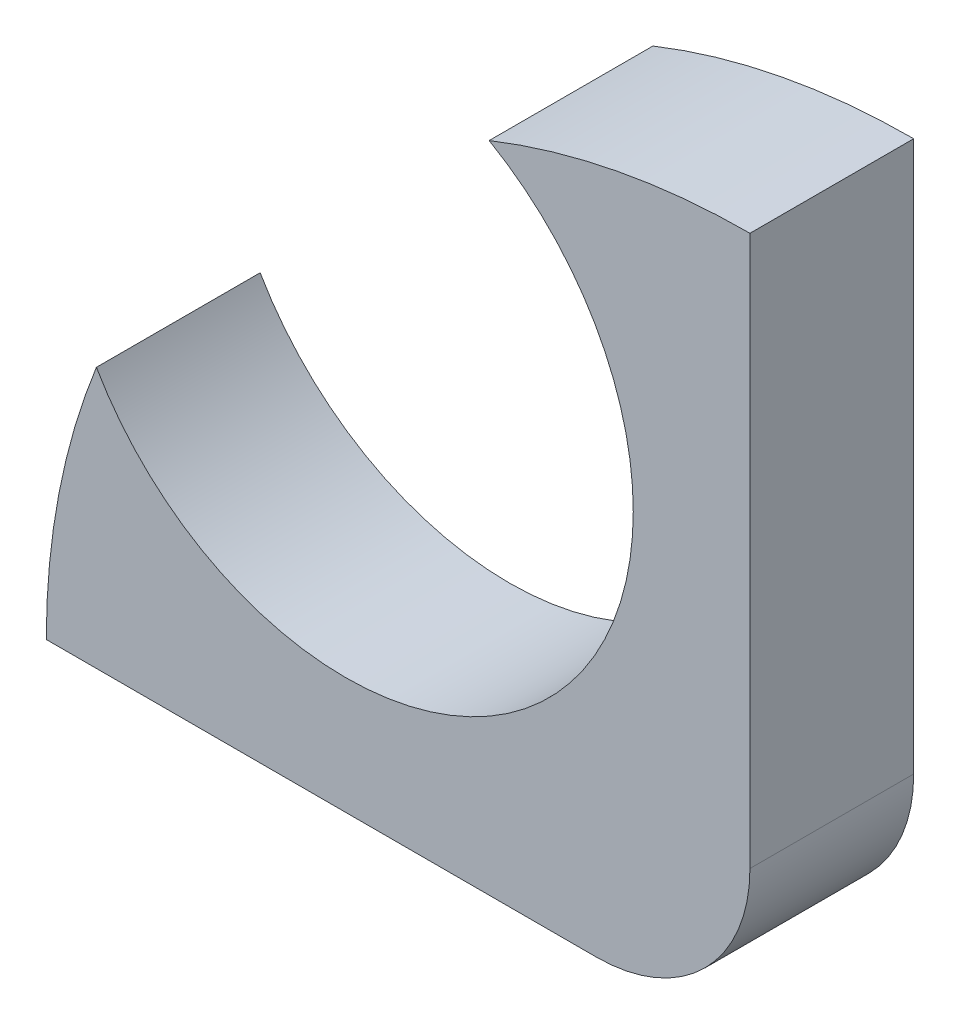
ISO-10303-21;
HEADER;
FILE_DESCRIPTION(('STEP AP214'),'2;1');
FILE_NAME('part.step','',(''),(''),'','','');
FILE_SCHEMA(('AUTOMOTIVE_DESIGN { 1 0 10303 214 1 1 1 1 }'));
ENDSEC;
DATA;
#1=APPLICATION_CONTEXT('core data for automotive mechanical design processes');
#2=APPLICATION_PROTOCOL_DEFINITION('international standard','automotive_design',2000,#1);
#3=PRODUCT_CONTEXT('',#1,'mechanical');
#4=PRODUCT('Part','Part','',(#3));
#5=PRODUCT_RELATED_PRODUCT_CATEGORY('part','',(#4));
#6=PRODUCT_DEFINITION_FORMATION('','',#4);
#7=PRODUCT_DEFINITION_CONTEXT('part definition',#1,'design');
#8=PRODUCT_DEFINITION('design','',#6,#7);
#9=PRODUCT_DEFINITION_SHAPE('','',#8);
#10=(LENGTH_UNIT() NAMED_UNIT(*) SI_UNIT(.MILLI.,.METRE.));
#11=(NAMED_UNIT(*) PLANE_ANGLE_UNIT() SI_UNIT($,.RADIAN.));
#12=(NAMED_UNIT(*) SI_UNIT($,.STERADIAN.) SOLID_ANGLE_UNIT());
#13=UNCERTAINTY_MEASURE_WITH_UNIT(LENGTH_MEASURE(1.E-05),#10,'distance_accuracy_value','');
#14=(GEOMETRIC_REPRESENTATION_CONTEXT(3) GLOBAL_UNCERTAINTY_ASSIGNED_CONTEXT((#13)) GLOBAL_UNIT_ASSIGNED_CONTEXT((#10,
#11,#12)) REPRESENTATION_CONTEXT('',''));
#15=CARTESIAN_POINT('',(0.,0.,0.));
#16=DIRECTION('',(0.,0.,1.));
#17=DIRECTION('',(1.,0.,0.));
#18=AXIS2_PLACEMENT_3D('',#15,#16,#17);
#19=CARTESIAN_POINT('',(18.45,-18.45,1.));
#20=DIRECTION('',(0.,0.,-1.));
#21=DIRECTION('',(0.,-1.,0.));
#22=AXIS2_PLACEMENT_3D('',#19,#20,#21);
#23=PLANE('',#22);
#24=CARTESIAN_POINT('',(18.45,-18.45,1.));
#25=DIRECTION('',(0.,0.,-1.));
#26=DIRECTION('',(-1.,0.,0.));
#27=AXIS2_PLACEMENT_3D('',#24,#25,#26);
#28=CIRCLE('',#27,1.5);
#29=CARTESIAN_POINT('',(19.95,-18.45,1.));
#30=VERTEX_POINT('',#29);
#31=CARTESIAN_POINT('',(18.45,-19.95,1.));
#32=VERTEX_POINT('',#31);
#33=EDGE_CURVE('E382',#30,#32,#28,.T.);
#34=ORIENTED_EDGE('',*,*,#33,.F.);
#35=DIRECTION('',(0.,-1.,0.));
#36=VECTOR('',#35,1.);
#37=CARTESIAN_POINT('',(19.95,-13.075,1.));
#38=LINE('',#37,#36);
#39=CARTESIAN_POINT('',(19.95,-13.075,1.));
#40=VERTEX_POINT('',#39);
#41=EDGE_CURVE('E27',#40,#30,#38,.T.);
#42=ORIENTED_EDGE('',*,*,#41,.F.);
#43=CARTESIAN_POINT('',(19.95,-19.95,1.));
#44=DIRECTION('',(0.,0.,-1.));
#45=DIRECTION('',(-1.,0.,0.));
#46=AXIS2_PLACEMENT_3D('',#43,#44,#45);
#47=CIRCLE('',#46,6.875);
#48=CARTESIAN_POINT('',(17.4018583423997,-13.5646574803851,1.));
#49=VERTEX_POINT('',#48);
#50=EDGE_CURVE('E131',#49,#40,#47,.T.);
#51=ORIENTED_EDGE('',*,*,#50,.F.);
#52=CARTESIAN_POINT('',(16.,-16.,1.));
#53=DIRECTION('',(0.,0.,1.));
#54=DIRECTION('',(-1.,0.,0.));
#55=AXIS2_PLACEMENT_3D('',#52,#53,#54);
#56=CIRCLE('',#55,2.81);
#57=CARTESIAN_POINT('',(18.81,-16.,1.));
#58=VERTEX_POINT('',#57);
#59=EDGE_CURVE('E142',#58,#49,#56,.T.);
#60=ORIENTED_EDGE('',*,*,#59,.F.);
#61=CARTESIAN_POINT('',(16.,-16.,1.));
#62=DIRECTION('',(0.,0.,1.));
#63=DIRECTION('',(-1.,0.,0.));
#64=AXIS2_PLACEMENT_3D('',#61,#62,#63);
#65=CIRCLE('',#64,2.81);
#66=CARTESIAN_POINT('',(13.5646574803851,-17.4018583423997,1.));
#67=VERTEX_POINT('',#66);
#68=EDGE_CURVE('E94',#67,#58,#65,.T.);
#69=ORIENTED_EDGE('',*,*,#68,.F.);
#70=CARTESIAN_POINT('',(19.95,-19.95,1.));
#71=DIRECTION('',(0.,0.,-1.));
#72=DIRECTION('',(-1.,0.,0.));
#73=AXIS2_PLACEMENT_3D('',#70,#71,#72);
#74=CIRCLE('',#73,6.875);
#75=CARTESIAN_POINT('',(13.075,-19.95,1.));
#76=VERTEX_POINT('',#75);
#77=EDGE_CURVE('E109',#76,#67,#74,.T.);
#78=ORIENTED_EDGE('',*,*,#77,.F.);
#79=DIRECTION('',(-1.,0.,0.));
#80=VECTOR('',#79,1.);
#81=CARTESIAN_POINT('',(18.45,-19.95,1.));
#82=LINE('',#81,#80);
#83=EDGE_CURVE('E151',#32,#76,#82,.T.);
#84=ORIENTED_EDGE('',*,*,#83,.F.);
#85=EDGE_LOOP('',(#34,#42,#51,#60,#69,#78,#84));
#86=FACE_BOUND('',#85,.T.);
#87=ADVANCED_FACE('F16',(#86),#23,.F.);
#88=CARTESIAN_POINT('',(18.45,-18.45,-0.6));
#89=DIRECTION('',(0.,0.,-1.));
#90=DIRECTION('',(0.,-1.,0.));
#91=AXIS2_PLACEMENT_3D('',#88,#89,#90);
#92=PLANE('',#91);
#93=CARTESIAN_POINT('',(18.45,-18.45,-0.6));
#94=DIRECTION('',(0.,0.,-1.));
#95=DIRECTION('',(-1.,0.,0.));
#96=AXIS2_PLACEMENT_3D('',#93,#94,#95);
#97=CIRCLE('',#96,1.5);
#98=CARTESIAN_POINT('',(19.95,-18.45,-0.6));
#99=VERTEX_POINT('',#98);
#100=CARTESIAN_POINT('',(18.45,-19.95,-0.6));
#101=VERTEX_POINT('',#100);
#102=EDGE_CURVE('E118',#99,#101,#97,.T.);
#103=ORIENTED_EDGE('',*,*,#102,.T.);
#104=DIRECTION('',(-1.,0.,0.));
#105=VECTOR('',#104,1.);
#106=CARTESIAN_POINT('',(18.45,-19.95,-0.6));
#107=LINE('',#106,#105);
#108=CARTESIAN_POINT('',(13.075,-19.95,-0.6));
#109=VERTEX_POINT('',#108);
#110=EDGE_CURVE('E102',#101,#109,#107,.T.);
#111=ORIENTED_EDGE('',*,*,#110,.T.);
#112=CARTESIAN_POINT('',(19.95,-19.95,-0.6));
#113=DIRECTION('',(0.,0.,-1.));
#114=DIRECTION('',(-1.,0.,0.));
#115=AXIS2_PLACEMENT_3D('',#112,#113,#114);
#116=CIRCLE('',#115,6.875);
#117=CARTESIAN_POINT('',(13.5646574803851,-17.4018583423997,-0.6));
#118=VERTEX_POINT('',#117);
#119=EDGE_CURVE('E95',#109,#118,#116,.T.);
#120=ORIENTED_EDGE('',*,*,#119,.T.);
#121=CARTESIAN_POINT('',(16.,-16.,-0.6));
#122=DIRECTION('',(0.,0.,1.));
#123=DIRECTION('',(-1.,0.,0.));
#124=AXIS2_PLACEMENT_3D('',#121,#122,#123);
#125=CIRCLE('',#124,2.81);
#126=CARTESIAN_POINT('',(18.81,-16.,-0.6));
#127=VERTEX_POINT('',#126);
#128=EDGE_CURVE('E82',#118,#127,#125,.T.);
#129=ORIENTED_EDGE('',*,*,#128,.T.);
#130=CARTESIAN_POINT('',(16.,-16.,-0.6));
#131=DIRECTION('',(0.,0.,1.));
#132=DIRECTION('',(-1.,0.,0.));
#133=AXIS2_PLACEMENT_3D('',#130,#131,#132);
#134=CIRCLE('',#133,2.81);
#135=CARTESIAN_POINT('',(17.4018583423997,-13.5646574803851,-0.6));
#136=VERTEX_POINT('',#135);
#137=EDGE_CURVE('E152',#127,#136,#134,.T.);
#138=ORIENTED_EDGE('',*,*,#137,.T.);
#139=CARTESIAN_POINT('',(19.95,-19.95,-0.6));
#140=DIRECTION('',(0.,0.,-1.));
#141=DIRECTION('',(-1.,0.,0.));
#142=AXIS2_PLACEMENT_3D('',#139,#140,#141);
#143=CIRCLE('',#142,6.875);
#144=CARTESIAN_POINT('',(19.95,-13.075,-0.6));
#145=VERTEX_POINT('',#144);
#146=EDGE_CURVE('E120',#136,#145,#143,.T.);
#147=ORIENTED_EDGE('',*,*,#146,.T.);
#148=DIRECTION('',(0.,-1.,0.));
#149=VECTOR('',#148,1.);
#150=CARTESIAN_POINT('',(19.95,-13.075,-0.6));
#151=LINE('',#150,#149);
#152=EDGE_CURVE('E11',#145,#99,#151,.T.);
#153=ORIENTED_EDGE('',*,*,#152,.T.);
#154=EDGE_LOOP('',(#103,#111,#120,#129,#138,#147,#153));
#155=FACE_BOUND('',#154,.T.);
#156=ADVANCED_FACE('F100',(#155),#92,.T.);
#157=CARTESIAN_POINT('',(19.95,-13.075,-0.6));
#158=DIRECTION('',(-1.,0.,0.));
#159=DIRECTION('',(0.,0.,1.));
#160=AXIS2_PLACEMENT_3D('',#157,#158,#159);
#161=PLANE('',#160);
#162=ORIENTED_EDGE('',*,*,#41,.T.);
#163=DIRECTION('',(0.,0.,1.));
#164=VECTOR('',#163,1.);
#165=CARTESIAN_POINT('',(19.95,-18.45,-0.6));
#166=LINE('',#165,#164);
#167=EDGE_CURVE('E147',#99,#30,#166,.T.);
#168=ORIENTED_EDGE('',*,*,#167,.F.);
#169=ORIENTED_EDGE('',*,*,#152,.F.);
#170=DIRECTION('',(0.,0.,1.));
#171=VECTOR('',#170,1.);
#172=CARTESIAN_POINT('',(19.95,-13.075,-0.6));
#173=LINE('',#172,#171);
#174=EDGE_CURVE('E122',#145,#40,#173,.T.);
#175=ORIENTED_EDGE('',*,*,#174,.T.);
#176=EDGE_LOOP('',(#162,#168,#169,#175));
#177=FACE_BOUND('',#176,.T.);
#178=ADVANCED_FACE('F208',(#177),#161,.F.);
#179=CARTESIAN_POINT('',(19.95,-19.95,-0.6));
#180=DIRECTION('',(0.,0.,1.));
#181=DIRECTION('',(1.,0.,0.));
#182=AXIS2_PLACEMENT_3D('',#179,#180,#181);
#183=CYLINDRICAL_SURFACE('',#182,6.875);
#184=ORIENTED_EDGE('',*,*,#50,.T.);
#185=ORIENTED_EDGE('',*,*,#174,.F.);
#186=ORIENTED_EDGE('',*,*,#146,.F.);
#187=DIRECTION('',(0.,0.,1.));
#188=VECTOR('',#187,1.);
#189=CARTESIAN_POINT('',(17.4018583423997,-13.5646574803851,-0.6));
#190=LINE('',#189,#188);
#191=EDGE_CURVE('E146',#136,#49,#190,.T.);
#192=ORIENTED_EDGE('',*,*,#191,.T.);
#193=EDGE_LOOP('',(#184,#185,#186,#192));
#194=FACE_BOUND('',#193,.T.);
#195=ADVANCED_FACE('F213',(#194),#183,.T.);
#196=CARTESIAN_POINT('',(16.,-16.,-0.6));
#197=DIRECTION('',(0.,0.,1.));
#198=DIRECTION('',(1.,0.,0.));
#199=AXIS2_PLACEMENT_3D('',#196,#197,#198);
#200=CYLINDRICAL_SURFACE('',#199,2.81);
#201=DIRECTION('',(0.,0.,1.));
#202=VECTOR('',#201,1.);
#203=CARTESIAN_POINT('',(18.81,-16.,-0.6));
#204=LINE('',#203,#202);
#205=EDGE_CURVE('E20',#127,#58,#204,.T.);
#206=ORIENTED_EDGE('',*,*,#205,.F.);
#207=ORIENTED_EDGE('',*,*,#128,.F.);
#208=DIRECTION('',(0.,0.,1.));
#209=VECTOR('',#208,1.);
#210=CARTESIAN_POINT('',(13.5646574803851,-17.4018583423997,-0.6));
#211=LINE('',#210,#209);
#212=EDGE_CURVE('E87',#118,#67,#211,.T.);
#213=ORIENTED_EDGE('',*,*,#212,.T.);
#214=ORIENTED_EDGE('',*,*,#68,.T.);
#215=EDGE_LOOP('',(#206,#207,#213,#214));
#216=FACE_BOUND('',#215,.T.);
#217=ADVANCED_FACE('F84',(#216),#200,.F.);
#218=CARTESIAN_POINT('',(19.95,-19.95,-0.6));
#219=DIRECTION('',(0.,0.,1.));
#220=DIRECTION('',(1.,0.,0.));
#221=AXIS2_PLACEMENT_3D('',#218,#219,#220);
#222=CYLINDRICAL_SURFACE('',#221,6.875);
#223=ORIENTED_EDGE('',*,*,#77,.T.);
#224=ORIENTED_EDGE('',*,*,#212,.F.);
#225=ORIENTED_EDGE('',*,*,#119,.F.);
#226=DIRECTION('',(0.,0.,1.));
#227=VECTOR('',#226,1.);
#228=CARTESIAN_POINT('',(13.075,-19.95,-0.6));
#229=LINE('',#228,#227);
#230=EDGE_CURVE('E139',#109,#76,#229,.T.);
#231=ORIENTED_EDGE('',*,*,#230,.T.);
#232=EDGE_LOOP('',(#223,#224,#225,#231));
#233=FACE_BOUND('',#232,.T.);
#234=ADVANCED_FACE('F108',(#233),#222,.T.);
#235=CARTESIAN_POINT('',(18.45,-19.95,-0.6));
#236=DIRECTION('',(0.,1.,0.));
#237=DIRECTION('',(1.,0.,0.));
#238=AXIS2_PLACEMENT_3D('',#235,#236,#237);
#239=PLANE('',#238);
#240=ORIENTED_EDGE('',*,*,#83,.T.);
#241=ORIENTED_EDGE('',*,*,#230,.F.);
#242=ORIENTED_EDGE('',*,*,#110,.F.);
#243=DIRECTION('',(0.,0.,1.));
#244=VECTOR('',#243,1.);
#245=CARTESIAN_POINT('',(18.45,-19.95,-0.6));
#246=LINE('',#245,#244);
#247=EDGE_CURVE('E194',#101,#32,#246,.T.);
#248=ORIENTED_EDGE('',*,*,#247,.T.);
#249=EDGE_LOOP('',(#240,#241,#242,#248));
#250=FACE_BOUND('',#249,.T.);
#251=ADVANCED_FACE('F18',(#250),#239,.F.);
#252=CARTESIAN_POINT('',(18.45,-18.45,-0.6));
#253=DIRECTION('',(0.,0.,1.));
#254=DIRECTION('',(1.,0.,0.));
#255=AXIS2_PLACEMENT_3D('',#252,#253,#254);
#256=CYLINDRICAL_SURFACE('',#255,1.5);
#257=ORIENTED_EDGE('',*,*,#33,.T.);
#258=ORIENTED_EDGE('',*,*,#247,.F.);
#259=ORIENTED_EDGE('',*,*,#102,.F.);
#260=ORIENTED_EDGE('',*,*,#167,.T.);
#261=EDGE_LOOP('',(#257,#258,#259,#260));
#262=FACE_BOUND('',#261,.T.);
#263=ADVANCED_FACE('F235',(#262),#256,.T.);
#264=CARTESIAN_POINT('',(16.,-16.,-0.6));
#265=DIRECTION('',(0.,0.,1.));
#266=DIRECTION('',(1.,0.,0.));
#267=AXIS2_PLACEMENT_3D('',#264,#265,#266);
#268=CYLINDRICAL_SURFACE('',#267,2.81);
#269=ORIENTED_EDGE('',*,*,#137,.F.);
#270=ORIENTED_EDGE('',*,*,#205,.T.);
#271=ORIENTED_EDGE('',*,*,#59,.T.);
#272=ORIENTED_EDGE('',*,*,#191,.F.);
#273=EDGE_LOOP('',(#269,#270,#271,#272));
#274=FACE_BOUND('',#273,.T.);
#275=ADVANCED_FACE('F165',(#274),#268,.F.);
#276=CLOSED_SHELL('',(#87,#156,#178,#195,#217,#234,#251,#263,#275));
#277=MANIFOLD_SOLID_BREP('B1',#276);
#278=ADVANCED_BREP_SHAPE_REPRESENTATION('',(#18,#277),#14);
#279=SHAPE_DEFINITION_REPRESENTATION(#9,#278);
ENDSEC;
END-ISO-10303-21;
